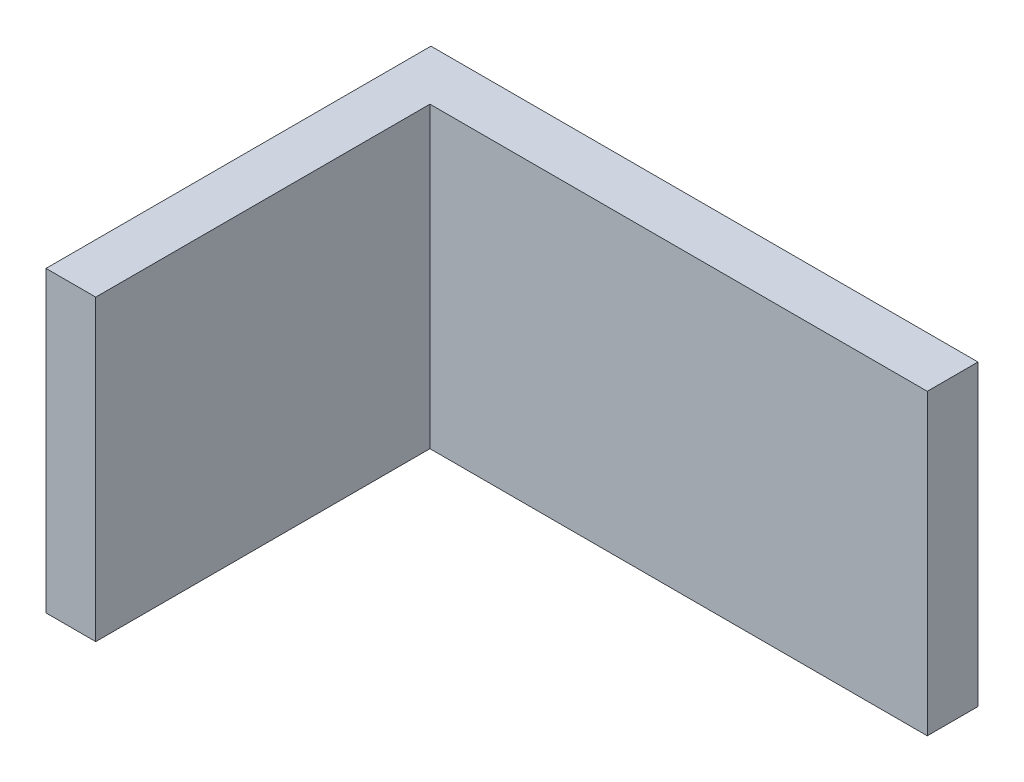
ISO-10303-21;
HEADER;
FILE_DESCRIPTION(('STEP AP214'),'2;1');
FILE_NAME('part.step','',(''),(''),'','','');
FILE_SCHEMA(('AUTOMOTIVE_DESIGN { 1 0 10303 214 1 1 1 1 }'));
ENDSEC;
DATA;
#1=APPLICATION_CONTEXT('core data for automotive mechanical design processes');
#2=APPLICATION_PROTOCOL_DEFINITION('international standard','automotive_design',2000,#1);
#3=PRODUCT_CONTEXT('',#1,'mechanical');
#4=PRODUCT('Part','Part','',(#3));
#5=PRODUCT_RELATED_PRODUCT_CATEGORY('part','',(#4));
#6=PRODUCT_DEFINITION_FORMATION('','',#4);
#7=PRODUCT_DEFINITION_CONTEXT('part definition',#1,'design');
#8=PRODUCT_DEFINITION('design','',#6,#7);
#9=PRODUCT_DEFINITION_SHAPE('','',#8);
#10=(LENGTH_UNIT() NAMED_UNIT(*) SI_UNIT(.MILLI.,.METRE.));
#11=(NAMED_UNIT(*) PLANE_ANGLE_UNIT() SI_UNIT($,.RADIAN.));
#12=(NAMED_UNIT(*) SI_UNIT($,.STERADIAN.) SOLID_ANGLE_UNIT());
#13=UNCERTAINTY_MEASURE_WITH_UNIT(LENGTH_MEASURE(1.E-05),#10,'distance_accuracy_value','');
#14=(GEOMETRIC_REPRESENTATION_CONTEXT(3) GLOBAL_UNCERTAINTY_ASSIGNED_CONTEXT((#13)) GLOBAL_UNIT_ASSIGNED_CONTEXT((#10,
#11,#12)) REPRESENTATION_CONTEXT('',''));
#15=CARTESIAN_POINT('',(0.,0.,0.));
#16=DIRECTION('',(0.,0.,1.));
#17=DIRECTION('',(1.,0.,0.));
#18=AXIS2_PLACEMENT_3D('',#15,#16,#17);
#19=CARTESIAN_POINT('',(-4.55,-3.9,0.));
#20=DIRECTION('',(0.,-1.,0.));
#21=DIRECTION('',(0.,0.,1.));
#22=AXIS2_PLACEMENT_3D('',#19,#20,#21);
#23=PLANE('',#22);
#24=DIRECTION('',(-1.,0.,0.));
#25=VECTOR('',#24,1.);
#26=CARTESIAN_POINT('',(-4.,-3.9,0.));
#27=LINE('',#26,#25);
#28=CARTESIAN_POINT('',(-4.,-3.9,0.));
#29=VERTEX_POINT('',#28);
#30=CARTESIAN_POINT('',(-4.55,-3.9,0.));
#31=VERTEX_POINT('',#30);
#32=EDGE_CURVE('E11',#29,#31,#27,.T.);
#33=ORIENTED_EDGE('',*,*,#32,.F.);
#34=DIRECTION('',(0.,0.,-1.));
#35=VECTOR('',#34,1.);
#36=CARTESIAN_POINT('',(-4.,-3.9,0.051));
#37=LINE('',#36,#35);
#38=CARTESIAN_POINT('',(-4.,-3.9,0.051));
#39=VERTEX_POINT('',#38);
#40=EDGE_CURVE('E24',#39,#29,#37,.T.);
#41=ORIENTED_EDGE('',*,*,#40,.F.);
#42=DIRECTION('',(1.,0.,0.));
#43=VECTOR('',#42,1.);
#44=CARTESIAN_POINT('',(-4.5,-3.9,0.051));
#45=LINE('',#44,#43);
#46=CARTESIAN_POINT('',(-4.5,-3.9,0.051));
#47=VERTEX_POINT('',#46);
#48=EDGE_CURVE('E87',#47,#39,#45,.T.);
#49=ORIENTED_EDGE('',*,*,#48,.F.);
#50=DIRECTION('',(0.,0.,-1.));
#51=VECTOR('',#50,1.);
#52=CARTESIAN_POINT('',(-4.5,-3.9,0.387));
#53=LINE('',#52,#51);
#54=CARTESIAN_POINT('',(-4.5,-3.9,0.387));
#55=VERTEX_POINT('',#54);
#56=EDGE_CURVE('E114',#55,#47,#53,.T.);
#57=ORIENTED_EDGE('',*,*,#56,.F.);
#58=DIRECTION('',(1.,0.,0.));
#59=VECTOR('',#58,1.);
#60=CARTESIAN_POINT('',(-4.55,-3.9,0.387));
#61=LINE('',#60,#59);
#62=CARTESIAN_POINT('',(-4.55,-3.9,0.387));
#63=VERTEX_POINT('',#62);
#64=EDGE_CURVE('E111',#63,#55,#61,.T.);
#65=ORIENTED_EDGE('',*,*,#64,.F.);
#66=DIRECTION('',(0.,0.,1.));
#67=VECTOR('',#66,1.);
#68=CARTESIAN_POINT('',(-4.55,-3.9,0.));
#69=LINE('',#68,#67);
#70=EDGE_CURVE('E108',#31,#63,#69,.T.);
#71=ORIENTED_EDGE('',*,*,#70,.F.);
#72=EDGE_LOOP('',(#33,#41,#49,#57,#65,#71));
#73=FACE_BOUND('',#72,.T.);
#74=ADVANCED_FACE('F17',(#73),#23,.T.);
#75=CARTESIAN_POINT('',(-4.,-3.6,0.));
#76=DIRECTION('',(0.,1.,0.));
#77=DIRECTION('',(0.,0.,1.));
#78=AXIS2_PLACEMENT_3D('',#75,#76,#77);
#79=PLANE('',#78);
#80=DIRECTION('',(1.,0.,0.));
#81=VECTOR('',#80,1.);
#82=CARTESIAN_POINT('',(-4.55,-3.6,0.));
#83=LINE('',#82,#81);
#84=CARTESIAN_POINT('',(-4.55,-3.6,0.));
#85=VERTEX_POINT('',#84);
#86=CARTESIAN_POINT('',(-4.,-3.6,0.));
#87=VERTEX_POINT('',#86);
#88=EDGE_CURVE('E106',#85,#87,#83,.T.);
#89=ORIENTED_EDGE('',*,*,#88,.F.);
#90=DIRECTION('',(0.,0.,-1.));
#91=VECTOR('',#90,1.);
#92=CARTESIAN_POINT('',(-4.55,-3.6,0.387));
#93=LINE('',#92,#91);
#94=CARTESIAN_POINT('',(-4.55,-3.6,0.387));
#95=VERTEX_POINT('',#94);
#96=EDGE_CURVE('E103',#95,#85,#93,.T.);
#97=ORIENTED_EDGE('',*,*,#96,.F.);
#98=DIRECTION('',(-1.,0.,0.));
#99=VECTOR('',#98,1.);
#100=CARTESIAN_POINT('',(-4.5,-3.6,0.387));
#101=LINE('',#100,#99);
#102=CARTESIAN_POINT('',(-4.5,-3.6,0.387));
#103=VERTEX_POINT('',#102);
#104=EDGE_CURVE('E100',#103,#95,#101,.T.);
#105=ORIENTED_EDGE('',*,*,#104,.F.);
#106=DIRECTION('',(0.,0.,1.));
#107=VECTOR('',#106,1.);
#108=CARTESIAN_POINT('',(-4.5,-3.6,0.051));
#109=LINE('',#108,#107);
#110=CARTESIAN_POINT('',(-4.5,-3.6,0.051));
#111=VERTEX_POINT('',#110);
#112=EDGE_CURVE('E72',#111,#103,#109,.T.);
#113=ORIENTED_EDGE('',*,*,#112,.F.);
#114=DIRECTION('',(-1.,0.,0.));
#115=VECTOR('',#114,1.);
#116=CARTESIAN_POINT('',(-4.,-3.6,0.051));
#117=LINE('',#116,#115);
#118=CARTESIAN_POINT('',(-4.,-3.6,0.051));
#119=VERTEX_POINT('',#118);
#120=EDGE_CURVE('E66',#119,#111,#117,.T.);
#121=ORIENTED_EDGE('',*,*,#120,.F.);
#122=DIRECTION('',(0.,0.,1.));
#123=VECTOR('',#122,1.);
#124=CARTESIAN_POINT('',(-4.,-3.6,0.));
#125=LINE('',#124,#123);
#126=EDGE_CURVE('E69',#87,#119,#125,.T.);
#127=ORIENTED_EDGE('',*,*,#126,.F.);
#128=EDGE_LOOP('',(#89,#97,#105,#113,#121,#127));
#129=FACE_BOUND('',#128,.T.);
#130=ADVANCED_FACE('F68',(#129),#79,.T.);
#131=CARTESIAN_POINT('',(-4.55,-3.9,0.387));
#132=DIRECTION('',(0.,0.,1.));
#133=DIRECTION('',(0.,1.,0.));
#134=AXIS2_PLACEMENT_3D('',#131,#132,#133);
#135=PLANE('',#134);
#136=ORIENTED_EDGE('',*,*,#64,.T.);
#137=DIRECTION('',(0.,-1.,0.));
#138=VECTOR('',#137,1.);
#139=CARTESIAN_POINT('',(-4.5,-3.6,0.387));
#140=LINE('',#139,#138);
#141=EDGE_CURVE('E83',#103,#55,#140,.T.);
#142=ORIENTED_EDGE('',*,*,#141,.F.);
#143=ORIENTED_EDGE('',*,*,#104,.T.);
#144=DIRECTION('',(0.,1.,0.));
#145=VECTOR('',#144,1.);
#146=CARTESIAN_POINT('',(-4.55,-3.9,0.387));
#147=LINE('',#146,#145);
#148=EDGE_CURVE('E88',#63,#95,#147,.T.);
#149=ORIENTED_EDGE('',*,*,#148,.F.);
#150=EDGE_LOOP('',(#136,#142,#143,#149));
#151=FACE_BOUND('',#150,.T.);
#152=ADVANCED_FACE('F125',(#151),#135,.T.);
#153=CARTESIAN_POINT('',(-4.5,-3.9,0.051));
#154=DIRECTION('',(0.,0.,1.));
#155=DIRECTION('',(0.,1.,0.));
#156=AXIS2_PLACEMENT_3D('',#153,#154,#155);
#157=PLANE('',#156);
#158=ORIENTED_EDGE('',*,*,#48,.T.);
#159=DIRECTION('',(0.,-1.,0.));
#160=VECTOR('',#159,1.);
#161=CARTESIAN_POINT('',(-4.,-3.6,0.051));
#162=LINE('',#161,#160);
#163=EDGE_CURVE('E81',#119,#39,#162,.T.);
#164=ORIENTED_EDGE('',*,*,#163,.F.);
#165=ORIENTED_EDGE('',*,*,#120,.T.);
#166=DIRECTION('',(0.,1.,0.));
#167=VECTOR('',#166,1.);
#168=CARTESIAN_POINT('',(-4.5,-3.9,0.051));
#169=LINE('',#168,#167);
#170=EDGE_CURVE('E89',#47,#111,#169,.T.);
#171=ORIENTED_EDGE('',*,*,#170,.F.);
#172=EDGE_LOOP('',(#158,#164,#165,#171));
#173=FACE_BOUND('',#172,.T.);
#174=ADVANCED_FACE('F86',(#173),#157,.T.);
#175=CARTESIAN_POINT('',(-4.55,-3.6,0.));
#176=DIRECTION('',(-1.,0.,0.));
#177=DIRECTION('',(0.,0.,1.));
#178=AXIS2_PLACEMENT_3D('',#175,#176,#177);
#179=PLANE('',#178);
#180=DIRECTION('',(0.,1.,0.));
#181=VECTOR('',#180,1.);
#182=CARTESIAN_POINT('',(-4.55,-3.9,0.));
#183=LINE('',#182,#181);
#184=EDGE_CURVE('E93',#31,#85,#183,.T.);
#185=ORIENTED_EDGE('',*,*,#184,.F.);
#186=ORIENTED_EDGE('',*,*,#70,.T.);
#187=ORIENTED_EDGE('',*,*,#148,.T.);
#188=ORIENTED_EDGE('',*,*,#96,.T.);
#189=EDGE_LOOP('',(#185,#186,#187,#188));
#190=FACE_BOUND('',#189,.T.);
#191=ADVANCED_FACE('F121',(#190),#179,.T.);
#192=CARTESIAN_POINT('',(-4.,-3.9,0.));
#193=DIRECTION('',(1.,0.,0.));
#194=DIRECTION('',(0.,0.,1.));
#195=AXIS2_PLACEMENT_3D('',#192,#193,#194);
#196=PLANE('',#195);
#197=DIRECTION('',(0.,-1.,0.));
#198=VECTOR('',#197,1.);
#199=CARTESIAN_POINT('',(-4.,-3.6,0.));
#200=LINE('',#199,#198);
#201=EDGE_CURVE('E82',#87,#29,#200,.T.);
#202=ORIENTED_EDGE('',*,*,#201,.F.);
#203=ORIENTED_EDGE('',*,*,#126,.T.);
#204=ORIENTED_EDGE('',*,*,#163,.T.);
#205=ORIENTED_EDGE('',*,*,#40,.T.);
#206=EDGE_LOOP('',(#202,#203,#204,#205));
#207=FACE_BOUND('',#206,.T.);
#208=ADVANCED_FACE('F80',(#207),#196,.T.);
#209=CARTESIAN_POINT('',(-4.5,-3.9,0.051));
#210=DIRECTION('',(1.,0.,0.));
#211=DIRECTION('',(0.,0.,1.));
#212=AXIS2_PLACEMENT_3D('',#209,#210,#211);
#213=PLANE('',#212);
#214=ORIENTED_EDGE('',*,*,#170,.T.);
#215=ORIENTED_EDGE('',*,*,#112,.T.);
#216=ORIENTED_EDGE('',*,*,#141,.T.);
#217=ORIENTED_EDGE('',*,*,#56,.T.);
#218=EDGE_LOOP('',(#214,#215,#216,#217));
#219=FACE_BOUND('',#218,.T.);
#220=ADVANCED_FACE('F127',(#219),#213,.T.);
#221=CARTESIAN_POINT('',(-4.55,-3.6,0.));
#222=DIRECTION('',(0.,0.,-1.));
#223=DIRECTION('',(0.,1.,0.));
#224=AXIS2_PLACEMENT_3D('',#221,#222,#223);
#225=PLANE('',#224);
#226=ORIENTED_EDGE('',*,*,#88,.T.);
#227=ORIENTED_EDGE('',*,*,#201,.T.);
#228=ORIENTED_EDGE('',*,*,#32,.T.);
#229=ORIENTED_EDGE('',*,*,#184,.T.);
#230=EDGE_LOOP('',(#226,#227,#228,#229));
#231=FACE_BOUND('',#230,.T.);
#232=ADVANCED_FACE('F117',(#231),#225,.T.);
#233=CLOSED_SHELL('',(#74,#130,#152,#174,#191,#208,#220,#232));
#234=MANIFOLD_SOLID_BREP('B1',#233);
#235=ADVANCED_BREP_SHAPE_REPRESENTATION('',(#18,#234),#14);
#236=SHAPE_DEFINITION_REPRESENTATION(#9,#235);
ENDSEC;
END-ISO-10303-21;
